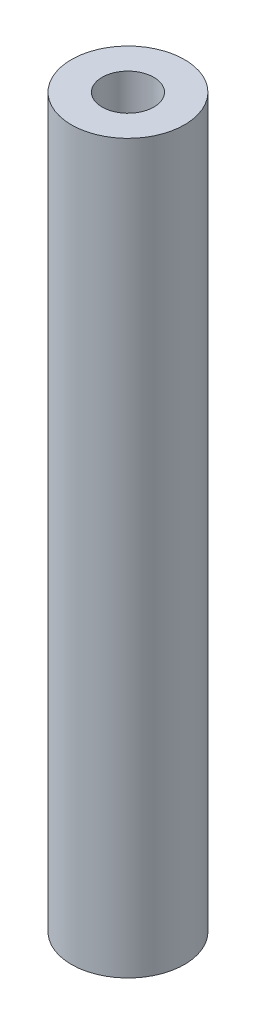
ISO-10303-21;
HEADER;
FILE_DESCRIPTION(('STEP AP214'),'2;1');
FILE_NAME('part.step','',(''),(''),'','','');
FILE_SCHEMA(('AUTOMOTIVE_DESIGN { 1 0 10303 214 1 1 1 1 }'));
ENDSEC;
DATA;
#1=APPLICATION_CONTEXT('core data for automotive mechanical design processes');
#2=APPLICATION_PROTOCOL_DEFINITION('international standard','automotive_design',2000,#1);
#3=PRODUCT_CONTEXT('',#1,'mechanical');
#4=PRODUCT('Part','Part','',(#3));
#5=PRODUCT_RELATED_PRODUCT_CATEGORY('part','',(#4));
#6=PRODUCT_DEFINITION_FORMATION('','',#4);
#7=PRODUCT_DEFINITION_CONTEXT('part definition',#1,'design');
#8=PRODUCT_DEFINITION('design','',#6,#7);
#9=PRODUCT_DEFINITION_SHAPE('','',#8);
#10=(LENGTH_UNIT() NAMED_UNIT(*) SI_UNIT(.MILLI.,.METRE.));
#11=(NAMED_UNIT(*) PLANE_ANGLE_UNIT() SI_UNIT($,.RADIAN.));
#12=(NAMED_UNIT(*) SI_UNIT($,.STERADIAN.) SOLID_ANGLE_UNIT());
#13=UNCERTAINTY_MEASURE_WITH_UNIT(LENGTH_MEASURE(1.E-05),#10,'distance_accuracy_value','');
#14=(GEOMETRIC_REPRESENTATION_CONTEXT(3) GLOBAL_UNCERTAINTY_ASSIGNED_CONTEXT((#13)) GLOBAL_UNIT_ASSIGNED_CONTEXT((#10,
#11,#12)) REPRESENTATION_CONTEXT('',''));
#15=CARTESIAN_POINT('',(0.,0.,0.));
#16=DIRECTION('',(0.,0.,1.));
#17=DIRECTION('',(1.,0.,0.));
#18=AXIS2_PLACEMENT_3D('',#15,#16,#17);
#19=CARTESIAN_POINT('',(0.,90.,0.));
#20=DIRECTION('',(0.,1.,0.));
#21=DIRECTION('',(0.,0.,1.));
#22=AXIS2_PLACEMENT_3D('',#19,#20,#21);
#23=PLANE('',#22);
#24=CARTESIAN_POINT('',(0.,90.,0.));
#25=DIRECTION('',(0.,1.,0.));
#26=DIRECTION('',(0.,0.,1.));
#27=AXIS2_PLACEMENT_3D('',#24,#25,#26);
#28=CIRCLE('',#27,7.);
#29=CARTESIAN_POINT('',(0.,90.,7.));
#30=VERTEX_POINT('',#29);
#31=EDGE_CURVE('E10',#30,#30,#28,.T.);
#32=ORIENTED_EDGE('',*,*,#31,.T.);
#33=EDGE_LOOP('',(#32));
#34=FACE_BOUND('',#33,.T.);
#35=CARTESIAN_POINT('',(0.,90.,0.));
#36=DIRECTION('',(0.,1.,0.));
#37=DIRECTION('',(0.,0.,1.));
#38=AXIS2_PLACEMENT_3D('',#35,#36,#37);
#39=CIRCLE('',#38,3.2);
#40=CARTESIAN_POINT('',(0.,90.,3.2));
#41=VERTEX_POINT('',#40);
#42=EDGE_CURVE('E54',#41,#41,#39,.T.);
#43=ORIENTED_EDGE('',*,*,#42,.F.);
#44=EDGE_LOOP('',(#43));
#45=FACE_BOUND('',#44,.T.);
#46=ADVANCED_FACE('F41',(#34,#45),#23,.T.);
#47=CARTESIAN_POINT('',(0.,0.,0.));
#48=DIRECTION('',(0.,1.,0.));
#49=DIRECTION('',(0.,0.,1.));
#50=AXIS2_PLACEMENT_3D('',#47,#48,#49);
#51=PLANE('',#50);
#52=CARTESIAN_POINT('',(0.,0.,0.));
#53=DIRECTION('',(0.,1.,0.));
#54=DIRECTION('',(0.,0.,1.));
#55=AXIS2_PLACEMENT_3D('',#52,#53,#54);
#56=CIRCLE('',#55,7.);
#57=CARTESIAN_POINT('',(0.,0.,7.));
#58=VERTEX_POINT('',#57);
#59=EDGE_CURVE('E45',#58,#58,#56,.T.);
#60=ORIENTED_EDGE('',*,*,#59,.F.);
#61=EDGE_LOOP('',(#60));
#62=FACE_BOUND('',#61,.T.);
#63=CARTESIAN_POINT('',(0.,0.,0.));
#64=DIRECTION('',(0.,1.,0.));
#65=DIRECTION('',(0.,0.,1.));
#66=AXIS2_PLACEMENT_3D('',#63,#64,#65);
#67=CIRCLE('',#66,3.2);
#68=CARTESIAN_POINT('',(0.,0.,3.2));
#69=VERTEX_POINT('',#68);
#70=EDGE_CURVE('E56',#69,#69,#67,.T.);
#71=ORIENTED_EDGE('',*,*,#70,.T.);
#72=EDGE_LOOP('',(#71));
#73=FACE_BOUND('',#72,.T.);
#74=ADVANCED_FACE('F68',(#62,#73),#51,.F.);
#75=CARTESIAN_POINT('',(0.,90.,0.));
#76=DIRECTION('',(0.,-1.,0.));
#77=DIRECTION('',(0.,0.,-1.));
#78=AXIS2_PLACEMENT_3D('',#75,#76,#77);
#79=CYLINDRICAL_SURFACE('',#78,7.);
#80=ORIENTED_EDGE('',*,*,#31,.F.);
#81=EDGE_LOOP('',(#80));
#82=FACE_BOUND('',#81,.T.);
#83=ORIENTED_EDGE('',*,*,#59,.T.);
#84=EDGE_LOOP('',(#83));
#85=FACE_BOUND('',#84,.T.);
#86=ADVANCED_FACE('F43',(#82,#85),#79,.T.);
#87=CARTESIAN_POINT('',(0.,90.,0.));
#88=DIRECTION('',(0.,-1.,0.));
#89=DIRECTION('',(0.,0.,-1.));
#90=AXIS2_PLACEMENT_3D('',#87,#88,#89);
#91=CYLINDRICAL_SURFACE('',#90,3.2);
#92=ORIENTED_EDGE('',*,*,#42,.T.);
#93=EDGE_LOOP('',(#92));
#94=FACE_BOUND('',#93,.T.);
#95=ORIENTED_EDGE('',*,*,#70,.F.);
#96=EDGE_LOOP('',(#95));
#97=FACE_BOUND('',#96,.T.);
#98=ADVANCED_FACE('F64',(#94,#97),#91,.F.);
#99=CLOSED_SHELL('',(#46,#74,#86,#98));
#100=MANIFOLD_SOLID_BREP('B2',#99);
#101=ADVANCED_BREP_SHAPE_REPRESENTATION('',(#18,#100),#14);
#102=SHAPE_DEFINITION_REPRESENTATION(#9,#101);
ENDSEC;
END-ISO-10303-21;
